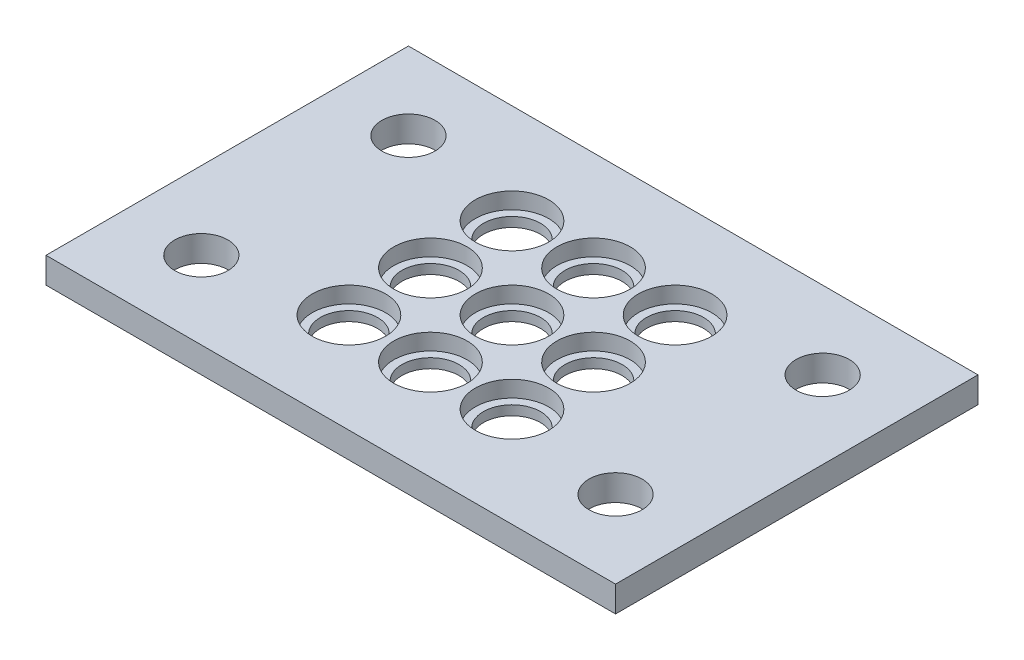
ISO-10303-21;
HEADER;
FILE_DESCRIPTION(('STEP AP214'),'2;1');
FILE_NAME('part.step','',(''),(''),'','','');
FILE_SCHEMA(('AUTOMOTIVE_DESIGN { 1 0 10303 214 1 1 1 1 }'));
ENDSEC;
DATA;
#1=APPLICATION_CONTEXT('core data for automotive mechanical design processes');
#2=APPLICATION_PROTOCOL_DEFINITION('international standard','automotive_design',2000,#1);
#3=PRODUCT_CONTEXT('',#1,'mechanical');
#4=PRODUCT('Part','Part','',(#3));
#5=PRODUCT_RELATED_PRODUCT_CATEGORY('part','',(#4));
#6=PRODUCT_DEFINITION_FORMATION('','',#4);
#7=PRODUCT_DEFINITION_CONTEXT('part definition',#1,'design');
#8=PRODUCT_DEFINITION('design','',#6,#7);
#9=PRODUCT_DEFINITION_SHAPE('','',#8);
#10=(LENGTH_UNIT() NAMED_UNIT(*) SI_UNIT(.MILLI.,.METRE.));
#11=(NAMED_UNIT(*) PLANE_ANGLE_UNIT() SI_UNIT($,.RADIAN.));
#12=(NAMED_UNIT(*) SI_UNIT($,.STERADIAN.) SOLID_ANGLE_UNIT());
#13=UNCERTAINTY_MEASURE_WITH_UNIT(LENGTH_MEASURE(1.E-05),#10,'distance_accuracy_value','');
#14=(GEOMETRIC_REPRESENTATION_CONTEXT(3) GLOBAL_UNCERTAINTY_ASSIGNED_CONTEXT((#13)) GLOBAL_UNIT_ASSIGNED_CONTEXT((#10,
#11,#12)) REPRESENTATION_CONTEXT('',''));
#15=CARTESIAN_POINT('',(0.,0.,0.));
#16=DIRECTION('',(0.,0.,1.));
#17=DIRECTION('',(1.,0.,0.));
#18=AXIS2_PLACEMENT_3D('',#15,#16,#17);
#19=CARTESIAN_POINT('',(44.9249999999999,3.175,-32.2250000000001));
#20=DIRECTION('',(0.,-1.,0.));
#21=DIRECTION('',(0.,0.,-1.));
#22=AXIS2_PLACEMENT_3D('',#19,#20,#21);
#23=CYLINDRICAL_SURFACE('',#22,3.5);
#24=CARTESIAN_POINT('',(44.9249999999999,0.,-32.2250000000001));
#25=DIRECTION('',(0.,1.,0.));
#26=DIRECTION('',(0.,0.,1.));
#27=AXIS2_PLACEMENT_3D('',#24,#25,#26);
#28=CIRCLE('',#27,3.5);
#29=CARTESIAN_POINT('',(44.9249999999999,0.,-28.7250000000001));
#30=VERTEX_POINT('',#29);
#31=EDGE_CURVE('E209',#30,#30,#28,.T.);
#32=ORIENTED_EDGE('',*,*,#31,.F.);
#33=EDGE_LOOP('',(#32));
#34=FACE_BOUND('',#33,.T.);
#35=CARTESIAN_POINT('',(44.9249999999999,1.175,-32.2250000000001));
#36=DIRECTION('',(0.,1.,0.));
#37=DIRECTION('',(0.,0.,1.));
#38=AXIS2_PLACEMENT_3D('',#35,#36,#37);
#39=CIRCLE('',#38,3.5);
#40=CARTESIAN_POINT('',(44.9249999999999,1.175,-28.7250000000001));
#41=VERTEX_POINT('',#40);
#42=EDGE_CURVE('E50',#41,#41,#39,.T.);
#43=ORIENTED_EDGE('',*,*,#42,.T.);
#44=EDGE_LOOP('',(#43));
#45=FACE_BOUND('',#44,.T.);
#46=ADVANCED_FACE('F46',(#34,#45),#23,.F.);
#47=CARTESIAN_POINT('',(34.9249999999999,3.175,-32.225));
#48=DIRECTION('',(0.,-1.,0.));
#49=DIRECTION('',(0.,0.,-1.));
#50=AXIS2_PLACEMENT_3D('',#47,#48,#49);
#51=CYLINDRICAL_SURFACE('',#50,3.5);
#52=CARTESIAN_POINT('',(34.9249999999999,0.,-32.225));
#53=DIRECTION('',(0.,1.,0.));
#54=DIRECTION('',(0.,0.,1.));
#55=AXIS2_PLACEMENT_3D('',#52,#53,#54);
#56=CIRCLE('',#55,3.5);
#57=CARTESIAN_POINT('',(34.9249999999999,0.,-28.725));
#58=VERTEX_POINT('',#57);
#59=EDGE_CURVE('E205',#58,#58,#56,.T.);
#60=ORIENTED_EDGE('',*,*,#59,.F.);
#61=EDGE_LOOP('',(#60));
#62=FACE_BOUND('',#61,.T.);
#63=CARTESIAN_POINT('',(34.9249999999999,1.175,-32.225));
#64=DIRECTION('',(0.,1.,0.));
#65=DIRECTION('',(0.,0.,1.));
#66=AXIS2_PLACEMENT_3D('',#63,#64,#65);
#67=CIRCLE('',#66,3.5);
#68=CARTESIAN_POINT('',(34.9249999999999,1.175,-28.725));
#69=VERTEX_POINT('',#68);
#70=EDGE_CURVE('E162',#69,#69,#67,.T.);
#71=ORIENTED_EDGE('',*,*,#70,.T.);
#72=EDGE_LOOP('',(#71));
#73=FACE_BOUND('',#72,.T.);
#74=ADVANCED_FACE('F265',(#62,#73),#51,.F.);
#75=CARTESIAN_POINT('',(24.9249999999999,3.175,-32.2249999999999));
#76=DIRECTION('',(0.,-1.,0.));
#77=DIRECTION('',(0.,0.,-1.));
#78=AXIS2_PLACEMENT_3D('',#75,#76,#77);
#79=CYLINDRICAL_SURFACE('',#78,3.5);
#80=CARTESIAN_POINT('',(24.9249999999999,0.,-32.2249999999999));
#81=DIRECTION('',(0.,1.,0.));
#82=DIRECTION('',(0.,0.,1.));
#83=AXIS2_PLACEMENT_3D('',#80,#81,#82);
#84=CIRCLE('',#83,3.5);
#85=CARTESIAN_POINT('',(24.9249999999999,0.,-28.7249999999999));
#86=VERTEX_POINT('',#85);
#87=EDGE_CURVE('E201',#86,#86,#84,.T.);
#88=ORIENTED_EDGE('',*,*,#87,.F.);
#89=EDGE_LOOP('',(#88));
#90=FACE_BOUND('',#89,.T.);
#91=CARTESIAN_POINT('',(24.9249999999999,1.175,-32.2249999999999));
#92=DIRECTION('',(0.,1.,0.));
#93=DIRECTION('',(0.,0.,1.));
#94=AXIS2_PLACEMENT_3D('',#91,#92,#93);
#95=CIRCLE('',#94,3.5);
#96=CARTESIAN_POINT('',(24.9249999999999,1.175,-28.7249999999999));
#97=VERTEX_POINT('',#96);
#98=EDGE_CURVE('E159',#97,#97,#95,.T.);
#99=ORIENTED_EDGE('',*,*,#98,.T.);
#100=EDGE_LOOP('',(#99));
#101=FACE_BOUND('',#100,.T.);
#102=ADVANCED_FACE('F272',(#90,#101),#79,.F.);
#103=CARTESIAN_POINT('',(34.925,3.175,-22.225));
#104=DIRECTION('',(0.,-1.,0.));
#105=DIRECTION('',(0.,0.,-1.));
#106=AXIS2_PLACEMENT_3D('',#103,#104,#105);
#107=CYLINDRICAL_SURFACE('',#106,3.5);
#108=CARTESIAN_POINT('',(34.925,0.,-22.225));
#109=DIRECTION('',(0.,1.,0.));
#110=DIRECTION('',(0.,0.,1.));
#111=AXIS2_PLACEMENT_3D('',#108,#109,#110);
#112=CIRCLE('',#111,3.5);
#113=CARTESIAN_POINT('',(34.925,0.,-18.725));
#114=VERTEX_POINT('',#113);
#115=EDGE_CURVE('E197',#114,#114,#112,.T.);
#116=ORIENTED_EDGE('',*,*,#115,.F.);
#117=EDGE_LOOP('',(#116));
#118=FACE_BOUND('',#117,.T.);
#119=CARTESIAN_POINT('',(34.925,1.175,-22.225));
#120=DIRECTION('',(0.,1.,0.));
#121=DIRECTION('',(0.,0.,1.));
#122=AXIS2_PLACEMENT_3D('',#119,#120,#121);
#123=CIRCLE('',#122,3.5);
#124=CARTESIAN_POINT('',(34.925,1.175,-18.725));
#125=VERTEX_POINT('',#124);
#126=EDGE_CURVE('E155',#125,#125,#123,.T.);
#127=ORIENTED_EDGE('',*,*,#126,.T.);
#128=EDGE_LOOP('',(#127));
#129=FACE_BOUND('',#128,.T.);
#130=ADVANCED_FACE('F470',(#118,#129),#107,.F.);
#131=CARTESIAN_POINT('',(24.925,3.175,-22.2249999999999));
#132=DIRECTION('',(0.,-1.,0.));
#133=DIRECTION('',(0.,0.,-1.));
#134=AXIS2_PLACEMENT_3D('',#131,#132,#133);
#135=CYLINDRICAL_SURFACE('',#134,3.5);
#136=CARTESIAN_POINT('',(24.925,0.,-22.2249999999999));
#137=DIRECTION('',(0.,1.,0.));
#138=DIRECTION('',(0.,0.,1.));
#139=AXIS2_PLACEMENT_3D('',#136,#137,#138);
#140=CIRCLE('',#139,3.5);
#141=CARTESIAN_POINT('',(24.925,0.,-18.7249999999999));
#142=VERTEX_POINT('',#141);
#143=EDGE_CURVE('E193',#142,#142,#140,.T.);
#144=ORIENTED_EDGE('',*,*,#143,.F.);
#145=EDGE_LOOP('',(#144));
#146=FACE_BOUND('',#145,.T.);
#147=CARTESIAN_POINT('',(24.925,1.175,-22.2249999999999));
#148=DIRECTION('',(0.,1.,0.));
#149=DIRECTION('',(0.,0.,1.));
#150=AXIS2_PLACEMENT_3D('',#147,#148,#149);
#151=CIRCLE('',#150,3.5);
#152=CARTESIAN_POINT('',(24.925,1.175,-18.7249999999999));
#153=VERTEX_POINT('',#152);
#154=EDGE_CURVE('E151',#153,#153,#151,.T.);
#155=ORIENTED_EDGE('',*,*,#154,.T.);
#156=EDGE_LOOP('',(#155));
#157=FACE_BOUND('',#156,.T.);
#158=ADVANCED_FACE('F466',(#146,#157),#135,.F.);
#159=CARTESIAN_POINT('',(34.9250000000001,3.175,-12.225));
#160=DIRECTION('',(0.,-1.,0.));
#161=DIRECTION('',(0.,0.,-1.));
#162=AXIS2_PLACEMENT_3D('',#159,#160,#161);
#163=CYLINDRICAL_SURFACE('',#162,3.5);
#164=CARTESIAN_POINT('',(34.9250000000001,0.,-12.225));
#165=DIRECTION('',(0.,1.,0.));
#166=DIRECTION('',(0.,0.,1.));
#167=AXIS2_PLACEMENT_3D('',#164,#165,#166);
#168=CIRCLE('',#167,3.5);
#169=CARTESIAN_POINT('',(34.9250000000001,0.,-8.725));
#170=VERTEX_POINT('',#169);
#171=EDGE_CURVE('E189',#170,#170,#168,.T.);
#172=ORIENTED_EDGE('',*,*,#171,.F.);
#173=EDGE_LOOP('',(#172));
#174=FACE_BOUND('',#173,.T.);
#175=CARTESIAN_POINT('',(34.9250000000001,1.175,-12.225));
#176=DIRECTION('',(0.,1.,0.));
#177=DIRECTION('',(0.,0.,1.));
#178=AXIS2_PLACEMENT_3D('',#175,#176,#177);
#179=CIRCLE('',#178,3.5);
#180=CARTESIAN_POINT('',(34.9250000000001,1.175,-8.725));
#181=VERTEX_POINT('',#180);
#182=EDGE_CURVE('E147',#181,#181,#179,.T.);
#183=ORIENTED_EDGE('',*,*,#182,.T.);
#184=EDGE_LOOP('',(#183));
#185=FACE_BOUND('',#184,.T.);
#186=ADVANCED_FACE('F304',(#174,#185),#163,.F.);
#187=CARTESIAN_POINT('',(24.9250000000001,3.175,-12.2249999999999));
#188=DIRECTION('',(0.,-1.,0.));
#189=DIRECTION('',(0.,0.,-1.));
#190=AXIS2_PLACEMENT_3D('',#187,#188,#189);
#191=CYLINDRICAL_SURFACE('',#190,3.5);
#192=CARTESIAN_POINT('',(24.9250000000001,0.,-12.2249999999999));
#193=DIRECTION('',(0.,1.,0.));
#194=DIRECTION('',(0.,0.,1.));
#195=AXIS2_PLACEMENT_3D('',#192,#193,#194);
#196=CIRCLE('',#195,3.5);
#197=CARTESIAN_POINT('',(24.9250000000001,0.,-8.72499999999992));
#198=VERTEX_POINT('',#197);
#199=EDGE_CURVE('E180',#198,#198,#196,.T.);
#200=ORIENTED_EDGE('',*,*,#199,.F.);
#201=EDGE_LOOP('',(#200));
#202=FACE_BOUND('',#201,.T.);
#203=CARTESIAN_POINT('',(24.9250000000001,1.175,-12.2249999999999));
#204=DIRECTION('',(0.,1.,0.));
#205=DIRECTION('',(0.,0.,1.));
#206=AXIS2_PLACEMENT_3D('',#203,#204,#205);
#207=CIRCLE('',#206,3.5);
#208=CARTESIAN_POINT('',(24.9250000000001,1.175,-8.72499999999992));
#209=VERTEX_POINT('',#208);
#210=EDGE_CURVE('E143',#209,#209,#207,.T.);
#211=ORIENTED_EDGE('',*,*,#210,.T.);
#212=EDGE_LOOP('',(#211));
#213=FACE_BOUND('',#212,.T.);
#214=ADVANCED_FACE('F300',(#202,#213),#191,.F.);
#215=CARTESIAN_POINT('',(44.925,3.175,-22.2250000000001));
#216=DIRECTION('',(0.,-1.,0.));
#217=DIRECTION('',(0.,0.,-1.));
#218=AXIS2_PLACEMENT_3D('',#215,#216,#217);
#219=CYLINDRICAL_SURFACE('',#218,3.5);
#220=CARTESIAN_POINT('',(44.925,0.,-22.2250000000001));
#221=DIRECTION('',(0.,1.,0.));
#222=DIRECTION('',(0.,0.,1.));
#223=AXIS2_PLACEMENT_3D('',#220,#221,#222);
#224=CIRCLE('',#223,3.5);
#225=CARTESIAN_POINT('',(44.925,0.,-18.7250000000001));
#226=VERTEX_POINT('',#225);
#227=EDGE_CURVE('E174',#226,#226,#224,.T.);
#228=ORIENTED_EDGE('',*,*,#227,.F.);
#229=EDGE_LOOP('',(#228));
#230=FACE_BOUND('',#229,.T.);
#231=CARTESIAN_POINT('',(44.925,1.175,-22.2250000000001));
#232=DIRECTION('',(0.,1.,0.));
#233=DIRECTION('',(0.,0.,1.));
#234=AXIS2_PLACEMENT_3D('',#231,#232,#233);
#235=CIRCLE('',#234,3.5);
#236=CARTESIAN_POINT('',(44.925,1.175,-18.7250000000001));
#237=VERTEX_POINT('',#236);
#238=EDGE_CURVE('E138',#237,#237,#235,.T.);
#239=ORIENTED_EDGE('',*,*,#238,.T.);
#240=EDGE_LOOP('',(#239));
#241=FACE_BOUND('',#240,.T.);
#242=ADVANCED_FACE('F303',(#230,#241),#219,.F.);
#243=CARTESIAN_POINT('',(44.9250000000001,3.175,-12.2250000000001));
#244=DIRECTION('',(0.,-1.,0.));
#245=DIRECTION('',(0.,0.,-1.));
#246=AXIS2_PLACEMENT_3D('',#243,#244,#245);
#247=CYLINDRICAL_SURFACE('',#246,3.5);
#248=CARTESIAN_POINT('',(44.9250000000001,0.,-12.2250000000001));
#249=DIRECTION('',(0.,1.,0.));
#250=DIRECTION('',(0.,0.,1.));
#251=AXIS2_PLACEMENT_3D('',#248,#249,#250);
#252=CIRCLE('',#251,3.5);
#253=CARTESIAN_POINT('',(44.9250000000001,0.,-8.72500000000007));
#254=VERTEX_POINT('',#253);
#255=EDGE_CURVE('E169',#254,#254,#252,.T.);
#256=ORIENTED_EDGE('',*,*,#255,.F.);
#257=EDGE_LOOP('',(#256));
#258=FACE_BOUND('',#257,.T.);
#259=CARTESIAN_POINT('',(44.9250000000001,1.175,-12.2250000000001));
#260=DIRECTION('',(0.,1.,0.));
#261=DIRECTION('',(0.,0.,1.));
#262=AXIS2_PLACEMENT_3D('',#259,#260,#261);
#263=CIRCLE('',#262,3.5);
#264=CARTESIAN_POINT('',(44.9250000000001,1.175,-8.72500000000007));
#265=VERTEX_POINT('',#264);
#266=EDGE_CURVE('E134',#265,#265,#263,.T.);
#267=ORIENTED_EDGE('',*,*,#266,.T.);
#268=EDGE_LOOP('',(#267));
#269=FACE_BOUND('',#268,.T.);
#270=ADVANCED_FACE('F396',(#258,#269),#247,.F.);
#271=CARTESIAN_POINT('',(0.,3.175,0.));
#272=DIRECTION('',(0.,-1.,0.));
#273=DIRECTION('',(0.,0.,-1.));
#274=AXIS2_PLACEMENT_3D('',#271,#272,#273);
#275=PLANE('',#274);
#276=CARTESIAN_POINT('',(34.9250000000001,3.175,-12.225));
#277=DIRECTION('',(0.,1.,0.));
#278=DIRECTION('',(0.,0.,1.));
#279=AXIS2_PLACEMENT_3D('',#276,#277,#278);
#280=CIRCLE('',#279,4.5);
#281=CARTESIAN_POINT('',(34.9250000000001,3.175,-7.725));
#282=VERTEX_POINT('',#281);
#283=EDGE_CURVE('E349',#282,#282,#280,.T.);
#284=ORIENTED_EDGE('',*,*,#283,.F.);
#285=EDGE_LOOP('',(#284));
#286=FACE_BOUND('',#285,.T.);
#287=CARTESIAN_POINT('',(24.9250000000001,3.175,-12.2249999999999));
#288=DIRECTION('',(0.,1.,0.));
#289=DIRECTION('',(0.,0.,1.));
#290=AXIS2_PLACEMENT_3D('',#287,#288,#289);
#291=CIRCLE('',#290,4.5);
#292=CARTESIAN_POINT('',(24.9250000000001,3.175,-7.72499999999993));
#293=VERTEX_POINT('',#292);
#294=EDGE_CURVE('E319',#293,#293,#291,.T.);
#295=ORIENTED_EDGE('',*,*,#294,.F.);
#296=EDGE_LOOP('',(#295));
#297=FACE_BOUND('',#296,.T.);
#298=CARTESIAN_POINT('',(34.9250000000001,3.175,-22.225));
#299=DIRECTION('',(0.,1.,0.));
#300=DIRECTION('',(0.,0.,1.));
#301=AXIS2_PLACEMENT_3D('',#298,#299,#300);
#302=CIRCLE('',#301,4.5);
#303=CARTESIAN_POINT('',(34.9250000000001,3.175,-17.725));
#304=VERTEX_POINT('',#303);
#305=EDGE_CURVE('E320',#304,#304,#302,.T.);
#306=ORIENTED_EDGE('',*,*,#305,.F.);
#307=EDGE_LOOP('',(#306));
#308=FACE_BOUND('',#307,.T.);
#309=CARTESIAN_POINT('',(24.9250000000001,3.175,-22.2249999999999));
#310=DIRECTION('',(0.,1.,0.));
#311=DIRECTION('',(0.,0.,1.));
#312=AXIS2_PLACEMENT_3D('',#309,#310,#311);
#313=CIRCLE('',#312,4.5);
#314=CARTESIAN_POINT('',(24.9250000000001,3.175,-17.7249999999999));
#315=VERTEX_POINT('',#314);
#316=EDGE_CURVE('E335',#315,#315,#313,.T.);
#317=ORIENTED_EDGE('',*,*,#316,.F.);
#318=EDGE_LOOP('',(#317));
#319=FACE_BOUND('',#318,.T.);
#320=CARTESIAN_POINT('',(34.925,3.175,-32.225));
#321=DIRECTION('',(0.,1.,0.));
#322=DIRECTION('',(0.,0.,1.));
#323=AXIS2_PLACEMENT_3D('',#320,#321,#322);
#324=CIRCLE('',#323,4.5);
#325=CARTESIAN_POINT('',(34.925,3.175,-27.725));
#326=VERTEX_POINT('',#325);
#327=EDGE_CURVE('E342',#326,#326,#324,.T.);
#328=ORIENTED_EDGE('',*,*,#327,.F.);
#329=EDGE_LOOP('',(#328));
#330=FACE_BOUND('',#329,.T.);
#331=CARTESIAN_POINT('',(24.925,3.175,-32.2249999999999));
#332=DIRECTION('',(0.,1.,0.));
#333=DIRECTION('',(0.,0.,1.));
#334=AXIS2_PLACEMENT_3D('',#331,#332,#333);
#335=CIRCLE('',#334,4.5);
#336=CARTESIAN_POINT('',(24.925,3.175,-27.7249999999999));
#337=VERTEX_POINT('',#336);
#338=EDGE_CURVE('E380',#337,#337,#335,.T.);
#339=ORIENTED_EDGE('',*,*,#338,.F.);
#340=EDGE_LOOP('',(#339));
#341=FACE_BOUND('',#340,.T.);
#342=CARTESIAN_POINT('',(44.9250000000001,3.175,-22.2250000000001));
#343=DIRECTION('',(0.,1.,0.));
#344=DIRECTION('',(0.,0.,1.));
#345=AXIS2_PLACEMENT_3D('',#342,#343,#344);
#346=CIRCLE('',#345,4.5);
#347=CARTESIAN_POINT('',(44.9250000000001,3.175,-17.7250000000001));
#348=VERTEX_POINT('',#347);
#349=EDGE_CURVE('E372',#348,#348,#346,.T.);
#350=ORIENTED_EDGE('',*,*,#349,.F.);
#351=EDGE_LOOP('',(#350));
#352=FACE_BOUND('',#351,.T.);
#353=CARTESIAN_POINT('',(44.925,3.175,-32.2250000000001));
#354=DIRECTION('',(0.,1.,0.));
#355=DIRECTION('',(0.,0.,1.));
#356=AXIS2_PLACEMENT_3D('',#353,#354,#355);
#357=CIRCLE('',#356,4.5);
#358=CARTESIAN_POINT('',(44.925,3.175,-27.7250000000001));
#359=VERTEX_POINT('',#358);
#360=EDGE_CURVE('E364',#359,#359,#357,.T.);
#361=ORIENTED_EDGE('',*,*,#360,.F.);
#362=EDGE_LOOP('',(#361));
#363=FACE_BOUND('',#362,.T.);
#364=CARTESIAN_POINT('',(44.9250000000001,3.175,-12.2250000000001));
#365=DIRECTION('',(0.,1.,0.));
#366=DIRECTION('',(0.,0.,1.));
#367=AXIS2_PLACEMENT_3D('',#364,#365,#366);
#368=CIRCLE('',#367,4.5);
#369=CARTESIAN_POINT('',(44.9250000000001,3.175,-7.72500000000007));
#370=VERTEX_POINT('',#369);
#371=EDGE_CURVE('E183',#370,#370,#368,.T.);
#372=ORIENTED_EDGE('',*,*,#371,.F.);
#373=EDGE_LOOP('',(#372));
#374=FACE_BOUND('',#373,.T.);
#375=DIRECTION('',(0.,0.,1.));
#376=VECTOR('',#375,1.);
#377=CARTESIAN_POINT('',(0.,3.175,0.));
#378=LINE('',#377,#376);
#379=CARTESIAN_POINT('',(0.,3.175,-44.45));
#380=VERTEX_POINT('',#379);
#381=CARTESIAN_POINT('',(0.,3.175,0.));
#382=VERTEX_POINT('',#381);
#383=EDGE_CURVE('E102',#380,#382,#378,.T.);
#384=ORIENTED_EDGE('',*,*,#383,.T.);
#385=DIRECTION('',(1.,0.,0.));
#386=VECTOR('',#385,1.);
#387=CARTESIAN_POINT('',(0.,3.175,0.));
#388=LINE('',#387,#386);
#389=CARTESIAN_POINT('',(69.85,3.175,0.));
#390=VERTEX_POINT('',#389);
#391=EDGE_CURVE('E96',#382,#390,#388,.T.);
#392=ORIENTED_EDGE('',*,*,#391,.T.);
#393=DIRECTION('',(0.,0.,-1.));
#394=VECTOR('',#393,1.);
#395=CARTESIAN_POINT('',(69.85,3.175,0.));
#396=LINE('',#395,#394);
#397=CARTESIAN_POINT('',(69.85,3.175,-44.45));
#398=VERTEX_POINT('',#397);
#399=EDGE_CURVE('E100',#390,#398,#396,.T.);
#400=ORIENTED_EDGE('',*,*,#399,.T.);
#401=DIRECTION('',(-1.,0.,0.));
#402=VECTOR('',#401,1.);
#403=CARTESIAN_POINT('',(0.,3.175,-44.45));
#404=LINE('',#403,#402);
#405=EDGE_CURVE('E66',#398,#380,#404,.T.);
#406=ORIENTED_EDGE('',*,*,#405,.T.);
#407=EDGE_LOOP('',(#384,#392,#400,#406));
#408=FACE_BOUND('',#407,.T.);
#409=CARTESIAN_POINT('',(9.525,3.175,-34.925));
#410=DIRECTION('',(0.,1.,0.));
#411=DIRECTION('',(0.,0.,1.));
#412=AXIS2_PLACEMENT_3D('',#409,#410,#411);
#413=CIRCLE('',#412,3.2639);
#414=CARTESIAN_POINT('',(9.525,3.175,-31.6611));
#415=VERTEX_POINT('',#414);
#416=EDGE_CURVE('E123',#415,#415,#413,.T.);
#417=ORIENTED_EDGE('',*,*,#416,.F.);
#418=EDGE_LOOP('',(#417));
#419=FACE_BOUND('',#418,.T.);
#420=CARTESIAN_POINT('',(60.325,3.175,-34.925));
#421=DIRECTION('',(0.,1.,0.));
#422=DIRECTION('',(0.,0.,1.));
#423=AXIS2_PLACEMENT_3D('',#420,#421,#422);
#424=CIRCLE('',#423,3.2639);
#425=CARTESIAN_POINT('',(60.325,3.175,-31.6611));
#426=VERTEX_POINT('',#425);
#427=EDGE_CURVE('E230',#426,#426,#424,.T.);
#428=ORIENTED_EDGE('',*,*,#427,.F.);
#429=EDGE_LOOP('',(#428));
#430=FACE_BOUND('',#429,.T.);
#431=CARTESIAN_POINT('',(9.525,3.175,-9.525));
#432=DIRECTION('',(0.,1.,0.));
#433=DIRECTION('',(0.,0.,1.));
#434=AXIS2_PLACEMENT_3D('',#431,#432,#433);
#435=CIRCLE('',#434,3.2639);
#436=CARTESIAN_POINT('',(9.525,3.175,-6.2611));
#437=VERTEX_POINT('',#436);
#438=EDGE_CURVE('E222',#437,#437,#435,.T.);
#439=ORIENTED_EDGE('',*,*,#438,.F.);
#440=EDGE_LOOP('',(#439));
#441=FACE_BOUND('',#440,.T.);
#442=CARTESIAN_POINT('',(60.325,3.175,-9.525));
#443=DIRECTION('',(0.,1.,0.));
#444=DIRECTION('',(0.,0.,1.));
#445=AXIS2_PLACEMENT_3D('',#442,#443,#444);
#446=CIRCLE('',#445,3.2639);
#447=CARTESIAN_POINT('',(60.325,3.175,-6.2611));
#448=VERTEX_POINT('',#447);
#449=EDGE_CURVE('E214',#448,#448,#446,.T.);
#450=ORIENTED_EDGE('',*,*,#449,.F.);
#451=EDGE_LOOP('',(#450));
#452=FACE_BOUND('',#451,.T.);
#453=ADVANCED_FACE('F97',(#286,#297,#308,#319,#330,#341,#352,#363,#374,#408,#419,#430,#441,
#452),#275,.F.);
#454=CARTESIAN_POINT('',(0.,0.,0.));
#455=DIRECTION('',(0.,-1.,0.));
#456=DIRECTION('',(0.,0.,-1.));
#457=AXIS2_PLACEMENT_3D('',#454,#455,#456);
#458=PLANE('',#457);
#459=ORIENTED_EDGE('',*,*,#227,.T.);
#460=EDGE_LOOP('',(#459));
#461=FACE_BOUND('',#460,.T.);
#462=ORIENTED_EDGE('',*,*,#171,.T.);
#463=EDGE_LOOP('',(#462));
#464=FACE_BOUND('',#463,.T.);
#465=ORIENTED_EDGE('',*,*,#115,.T.);
#466=EDGE_LOOP('',(#465));
#467=FACE_BOUND('',#466,.T.);
#468=ORIENTED_EDGE('',*,*,#59,.T.);
#469=EDGE_LOOP('',(#468));
#470=FACE_BOUND('',#469,.T.);
#471=CARTESIAN_POINT('',(60.325,0.,-9.525));
#472=DIRECTION('',(0.,1.,0.));
#473=DIRECTION('',(0.,0.,1.));
#474=AXIS2_PLACEMENT_3D('',#471,#472,#473);
#475=CIRCLE('',#474,3.2639);
#476=CARTESIAN_POINT('',(60.325,0.,-6.2611));
#477=VERTEX_POINT('',#476);
#478=EDGE_CURVE('E213',#477,#477,#475,.T.);
#479=ORIENTED_EDGE('',*,*,#478,.T.);
#480=EDGE_LOOP('',(#479));
#481=FACE_BOUND('',#480,.T.);
#482=CARTESIAN_POINT('',(60.325,0.,-34.925));
#483=DIRECTION('',(0.,1.,0.));
#484=DIRECTION('',(0.,0.,1.));
#485=AXIS2_PLACEMENT_3D('',#482,#483,#484);
#486=CIRCLE('',#485,3.2639);
#487=CARTESIAN_POINT('',(60.325,0.,-31.6611));
#488=VERTEX_POINT('',#487);
#489=EDGE_CURVE('E226',#488,#488,#486,.T.);
#490=ORIENTED_EDGE('',*,*,#489,.T.);
#491=EDGE_LOOP('',(#490));
#492=FACE_BOUND('',#491,.T.);
#493=DIRECTION('',(0.,0.,1.));
#494=VECTOR('',#493,1.);
#495=CARTESIAN_POINT('',(0.,0.,0.));
#496=LINE('',#495,#494);
#497=CARTESIAN_POINT('',(0.,0.,-44.45));
#498=VERTEX_POINT('',#497);
#499=CARTESIAN_POINT('',(0.,0.,0.));
#500=VERTEX_POINT('',#499);
#501=EDGE_CURVE('E119',#498,#500,#496,.T.);
#502=ORIENTED_EDGE('',*,*,#501,.F.);
#503=DIRECTION('',(-1.,0.,0.));
#504=VECTOR('',#503,1.);
#505=CARTESIAN_POINT('',(0.,0.,-44.45));
#506=LINE('',#505,#504);
#507=CARTESIAN_POINT('',(69.85,0.,-44.45));
#508=VERTEX_POINT('',#507);
#509=EDGE_CURVE('E89',#508,#498,#506,.T.);
#510=ORIENTED_EDGE('',*,*,#509,.F.);
#511=DIRECTION('',(0.,0.,-1.));
#512=VECTOR('',#511,1.);
#513=CARTESIAN_POINT('',(69.85,0.,0.));
#514=LINE('',#513,#512);
#515=CARTESIAN_POINT('',(69.85,0.,0.));
#516=VERTEX_POINT('',#515);
#517=EDGE_CURVE('E83',#516,#508,#514,.T.);
#518=ORIENTED_EDGE('',*,*,#517,.F.);
#519=DIRECTION('',(1.,0.,0.));
#520=VECTOR('',#519,1.);
#521=CARTESIAN_POINT('',(0.,0.,0.));
#522=LINE('',#521,#520);
#523=EDGE_CURVE('E107',#500,#516,#522,.T.);
#524=ORIENTED_EDGE('',*,*,#523,.F.);
#525=EDGE_LOOP('',(#502,#510,#518,#524));
#526=FACE_BOUND('',#525,.T.);
#527=CARTESIAN_POINT('',(9.525,0.,-34.925));
#528=DIRECTION('',(0.,1.,0.));
#529=DIRECTION('',(0.,0.,1.));
#530=AXIS2_PLACEMENT_3D('',#527,#528,#529);
#531=CIRCLE('',#530,3.2639);
#532=CARTESIAN_POINT('',(9.525,0.,-31.6611));
#533=VERTEX_POINT('',#532);
#534=EDGE_CURVE('E234',#533,#533,#531,.T.);
#535=ORIENTED_EDGE('',*,*,#534,.T.);
#536=EDGE_LOOP('',(#535));
#537=FACE_BOUND('',#536,.T.);
#538=CARTESIAN_POINT('',(9.525,0.,-9.525));
#539=DIRECTION('',(0.,1.,0.));
#540=DIRECTION('',(0.,0.,1.));
#541=AXIS2_PLACEMENT_3D('',#538,#539,#540);
#542=CIRCLE('',#541,3.2639);
#543=CARTESIAN_POINT('',(9.525,0.,-6.2611));
#544=VERTEX_POINT('',#543);
#545=EDGE_CURVE('E218',#544,#544,#542,.T.);
#546=ORIENTED_EDGE('',*,*,#545,.T.);
#547=EDGE_LOOP('',(#546));
#548=FACE_BOUND('',#547,.T.);
#549=ORIENTED_EDGE('',*,*,#31,.T.);
#550=EDGE_LOOP('',(#549));
#551=FACE_BOUND('',#550,.T.);
#552=ORIENTED_EDGE('',*,*,#87,.T.);
#553=EDGE_LOOP('',(#552));
#554=FACE_BOUND('',#553,.T.);
#555=ORIENTED_EDGE('',*,*,#143,.T.);
#556=EDGE_LOOP('',(#555));
#557=FACE_BOUND('',#556,.T.);
#558=ORIENTED_EDGE('',*,*,#199,.T.);
#559=EDGE_LOOP('',(#558));
#560=FACE_BOUND('',#559,.T.);
#561=ORIENTED_EDGE('',*,*,#255,.T.);
#562=EDGE_LOOP('',(#561));
#563=FACE_BOUND('',#562,.T.);
#564=ADVANCED_FACE('F246',(#461,#464,#467,#470,#481,#492,#526,#537,#548,#551,#554,#557,#560,
#563),#458,.T.);
#565=CARTESIAN_POINT('',(0.,3.175,0.));
#566=DIRECTION('',(1.,0.,0.));
#567=DIRECTION('',(0.,0.,-1.));
#568=AXIS2_PLACEMENT_3D('',#565,#566,#567);
#569=PLANE('',#568);
#570=ORIENTED_EDGE('',*,*,#501,.T.);
#571=DIRECTION('',(0.,-1.,0.));
#572=VECTOR('',#571,1.);
#573=CARTESIAN_POINT('',(0.,3.175,0.));
#574=LINE('',#573,#572);
#575=EDGE_CURVE('E12',#382,#500,#574,.T.);
#576=ORIENTED_EDGE('',*,*,#575,.F.);
#577=ORIENTED_EDGE('',*,*,#383,.F.);
#578=DIRECTION('',(0.,-1.,0.));
#579=VECTOR('',#578,1.);
#580=CARTESIAN_POINT('',(0.,3.175,-44.45));
#581=LINE('',#580,#579);
#582=EDGE_CURVE('E115',#380,#498,#581,.T.);
#583=ORIENTED_EDGE('',*,*,#582,.T.);
#584=EDGE_LOOP('',(#570,#576,#577,#583));
#585=FACE_BOUND('',#584,.T.);
#586=ADVANCED_FACE('F48',(#585),#569,.F.);
#587=CARTESIAN_POINT('',(0.,3.175,0.));
#588=DIRECTION('',(0.,0.,-1.));
#589=DIRECTION('',(-1.,0.,0.));
#590=AXIS2_PLACEMENT_3D('',#587,#588,#589);
#591=PLANE('',#590);
#592=ORIENTED_EDGE('',*,*,#523,.T.);
#593=DIRECTION('',(0.,-1.,0.));
#594=VECTOR('',#593,1.);
#595=CARTESIAN_POINT('',(69.85,3.175,0.));
#596=LINE('',#595,#594);
#597=EDGE_CURVE('E57',#390,#516,#596,.T.);
#598=ORIENTED_EDGE('',*,*,#597,.F.);
#599=ORIENTED_EDGE('',*,*,#391,.F.);
#600=ORIENTED_EDGE('',*,*,#575,.T.);
#601=EDGE_LOOP('',(#592,#598,#599,#600));
#602=FACE_BOUND('',#601,.T.);
#603=ADVANCED_FACE('F106',(#602),#591,.F.);
#604=CARTESIAN_POINT('',(69.85,3.175,0.));
#605=DIRECTION('',(-1.,0.,0.));
#606=DIRECTION('',(0.,0.,1.));
#607=AXIS2_PLACEMENT_3D('',#604,#605,#606);
#608=PLANE('',#607);
#609=ORIENTED_EDGE('',*,*,#517,.T.);
#610=DIRECTION('',(0.,-1.,0.));
#611=VECTOR('',#610,1.);
#612=CARTESIAN_POINT('',(69.85,3.175,-44.45));
#613=LINE('',#612,#611);
#614=EDGE_CURVE('E109',#398,#508,#613,.T.);
#615=ORIENTED_EDGE('',*,*,#614,.F.);
#616=ORIENTED_EDGE('',*,*,#399,.F.);
#617=ORIENTED_EDGE('',*,*,#597,.T.);
#618=EDGE_LOOP('',(#609,#615,#616,#617));
#619=FACE_BOUND('',#618,.T.);
#620=ADVANCED_FACE('F111',(#619),#608,.F.);
#621=CARTESIAN_POINT('',(0.,3.175,-44.45));
#622=DIRECTION('',(0.,0.,1.));
#623=DIRECTION('',(1.,0.,0.));
#624=AXIS2_PLACEMENT_3D('',#621,#622,#623);
#625=PLANE('',#624);
#626=ORIENTED_EDGE('',*,*,#509,.T.);
#627=ORIENTED_EDGE('',*,*,#582,.F.);
#628=ORIENTED_EDGE('',*,*,#405,.F.);
#629=ORIENTED_EDGE('',*,*,#614,.T.);
#630=EDGE_LOOP('',(#626,#627,#628,#629));
#631=FACE_BOUND('',#630,.T.);
#632=ADVANCED_FACE('F252',(#631),#625,.F.);
#633=CARTESIAN_POINT('',(9.525,3.175,-34.925));
#634=DIRECTION('',(0.,-1.,0.));
#635=DIRECTION('',(0.,0.,-1.));
#636=AXIS2_PLACEMENT_3D('',#633,#634,#635);
#637=CYLINDRICAL_SURFACE('',#636,3.2639);
#638=ORIENTED_EDGE('',*,*,#416,.T.);
#639=EDGE_LOOP('',(#638));
#640=FACE_BOUND('',#639,.T.);
#641=ORIENTED_EDGE('',*,*,#534,.F.);
#642=EDGE_LOOP('',(#641));
#643=FACE_BOUND('',#642,.T.);
#644=ADVANCED_FACE('F249',(#640,#643),#637,.F.);
#645=CARTESIAN_POINT('',(60.325,3.175,-34.925));
#646=DIRECTION('',(0.,-1.,0.));
#647=DIRECTION('',(0.,0.,-1.));
#648=AXIS2_PLACEMENT_3D('',#645,#646,#647);
#649=CYLINDRICAL_SURFACE('',#648,3.2639);
#650=ORIENTED_EDGE('',*,*,#427,.T.);
#651=EDGE_LOOP('',(#650));
#652=FACE_BOUND('',#651,.T.);
#653=ORIENTED_EDGE('',*,*,#489,.F.);
#654=EDGE_LOOP('',(#653));
#655=FACE_BOUND('',#654,.T.);
#656=ADVANCED_FACE('F251',(#652,#655),#649,.F.);
#657=CARTESIAN_POINT('',(9.525,3.175,-9.525));
#658=DIRECTION('',(0.,-1.,0.));
#659=DIRECTION('',(0.,0.,-1.));
#660=AXIS2_PLACEMENT_3D('',#657,#658,#659);
#661=CYLINDRICAL_SURFACE('',#660,3.2639);
#662=ORIENTED_EDGE('',*,*,#438,.T.);
#663=EDGE_LOOP('',(#662));
#664=FACE_BOUND('',#663,.T.);
#665=ORIENTED_EDGE('',*,*,#545,.F.);
#666=EDGE_LOOP('',(#665));
#667=FACE_BOUND('',#666,.T.);
#668=ADVANCED_FACE('F259',(#664,#667),#661,.F.);
#669=CARTESIAN_POINT('',(60.325,3.175,-9.525));
#670=DIRECTION('',(0.,-1.,0.));
#671=DIRECTION('',(0.,0.,-1.));
#672=AXIS2_PLACEMENT_3D('',#669,#670,#671);
#673=CYLINDRICAL_SURFACE('',#672,3.2639);
#674=ORIENTED_EDGE('',*,*,#449,.T.);
#675=EDGE_LOOP('',(#674));
#676=FACE_BOUND('',#675,.T.);
#677=ORIENTED_EDGE('',*,*,#478,.F.);
#678=EDGE_LOOP('',(#677));
#679=FACE_BOUND('',#678,.T.);
#680=ADVANCED_FACE('F278',(#676,#679),#673,.F.);
#681=CARTESIAN_POINT('',(44.9250000000001,1.175,-12.2250000000001));
#682=DIRECTION('',(0.,1.,0.));
#683=DIRECTION('',(0.,0.,1.));
#684=AXIS2_PLACEMENT_3D('',#681,#682,#683);
#685=CYLINDRICAL_SURFACE('',#684,4.5);
#686=CARTESIAN_POINT('',(44.9250000000001,1.175,-12.2250000000001));
#687=DIRECTION('',(0.,1.,0.));
#688=DIRECTION('',(0.,0.,1.));
#689=AXIS2_PLACEMENT_3D('',#686,#687,#688);
#690=CIRCLE('',#689,4.5);
#691=CARTESIAN_POINT('',(44.9250000000001,1.175,-7.72500000000007));
#692=VERTEX_POINT('',#691);
#693=EDGE_CURVE('E139',#692,#692,#690,.T.);
#694=ORIENTED_EDGE('',*,*,#693,.F.);
#695=EDGE_LOOP('',(#694));
#696=FACE_BOUND('',#695,.T.);
#697=ORIENTED_EDGE('',*,*,#371,.T.);
#698=EDGE_LOOP('',(#697));
#699=FACE_BOUND('',#698,.T.);
#700=ADVANCED_FACE('F280',(#696,#699),#685,.F.);
#701=CARTESIAN_POINT('',(44.9250000000001,1.175,-12.2250000000001));
#702=DIRECTION('',(0.,1.,0.));
#703=DIRECTION('',(0.,0.,1.));
#704=AXIS2_PLACEMENT_3D('',#701,#702,#703);
#705=PLANE('',#704);
#706=ORIENTED_EDGE('',*,*,#266,.F.);
#707=EDGE_LOOP('',(#706));
#708=FACE_BOUND('',#707,.T.);
#709=ORIENTED_EDGE('',*,*,#693,.T.);
#710=EDGE_LOOP('',(#709));
#711=FACE_BOUND('',#710,.T.);
#712=ADVANCED_FACE('F450',(#708,#711),#705,.T.);
#713=CARTESIAN_POINT('',(44.9250000000001,1.175,-22.2250000000001));
#714=DIRECTION('',(0.,1.,0.));
#715=DIRECTION('',(0.,0.,1.));
#716=AXIS2_PLACEMENT_3D('',#713,#714,#715);
#717=CYLINDRICAL_SURFACE('',#716,4.5);
#718=CARTESIAN_POINT('',(44.9250000000001,1.175,-22.2250000000001));
#719=DIRECTION('',(0.,1.,0.));
#720=DIRECTION('',(0.,0.,1.));
#721=AXIS2_PLACEMENT_3D('',#718,#719,#720);
#722=CIRCLE('',#721,4.5);
#723=CARTESIAN_POINT('',(44.9250000000001,1.175,-17.7250000000001));
#724=VERTEX_POINT('',#723);
#725=EDGE_CURVE('E368',#724,#724,#722,.T.);
#726=ORIENTED_EDGE('',*,*,#725,.F.);
#727=EDGE_LOOP('',(#726));
#728=FACE_BOUND('',#727,.T.);
#729=ORIENTED_EDGE('',*,*,#349,.T.);
#730=EDGE_LOOP('',(#729));
#731=FACE_BOUND('',#730,.T.);
#732=ADVANCED_FACE('F453',(#728,#731),#717,.F.);
#733=CARTESIAN_POINT('',(44.9250000000001,1.175,-22.2250000000001));
#734=DIRECTION('',(0.,1.,0.));
#735=DIRECTION('',(0.,0.,1.));
#736=AXIS2_PLACEMENT_3D('',#733,#734,#735);
#737=PLANE('',#736);
#738=ORIENTED_EDGE('',*,*,#238,.F.);
#739=EDGE_LOOP('',(#738));
#740=FACE_BOUND('',#739,.T.);
#741=ORIENTED_EDGE('',*,*,#725,.T.);
#742=EDGE_LOOP('',(#741));
#743=FACE_BOUND('',#742,.T.);
#744=ADVANCED_FACE('F421',(#740,#743),#737,.T.);
#745=CARTESIAN_POINT('',(24.9250000000001,1.175,-12.2249999999999));
#746=DIRECTION('',(0.,1.,0.));
#747=DIRECTION('',(0.,0.,1.));
#748=AXIS2_PLACEMENT_3D('',#745,#746,#747);
#749=CYLINDRICAL_SURFACE('',#748,4.5);
#750=CARTESIAN_POINT('',(24.9250000000001,1.175,-12.2249999999999));
#751=DIRECTION('',(0.,1.,0.));
#752=DIRECTION('',(0.,0.,1.));
#753=AXIS2_PLACEMENT_3D('',#750,#751,#752);
#754=CIRCLE('',#753,4.5);
#755=CARTESIAN_POINT('',(24.9250000000001,1.175,-7.72499999999993));
#756=VERTEX_POINT('',#755);
#757=EDGE_CURVE('E316',#756,#756,#754,.T.);
#758=ORIENTED_EDGE('',*,*,#757,.F.);
#759=EDGE_LOOP('',(#758));
#760=FACE_BOUND('',#759,.T.);
#761=ORIENTED_EDGE('',*,*,#294,.T.);
#762=EDGE_LOOP('',(#761));
#763=FACE_BOUND('',#762,.T.);
#764=ADVANCED_FACE('F312',(#760,#763),#749,.F.);
#765=CARTESIAN_POINT('',(24.9250000000001,1.175,-12.2249999999999));
#766=DIRECTION('',(0.,1.,0.));
#767=DIRECTION('',(0.,0.,1.));
#768=AXIS2_PLACEMENT_3D('',#765,#766,#767);
#769=PLANE('',#768);
#770=ORIENTED_EDGE('',*,*,#210,.F.);
#771=EDGE_LOOP('',(#770));
#772=FACE_BOUND('',#771,.T.);
#773=ORIENTED_EDGE('',*,*,#757,.T.);
#774=EDGE_LOOP('',(#773));
#775=FACE_BOUND('',#774,.T.);
#776=ADVANCED_FACE('F308',(#772,#775),#769,.T.);
#777=CARTESIAN_POINT('',(34.9250000000001,1.175,-12.225));
#778=DIRECTION('',(0.,1.,0.));
#779=DIRECTION('',(0.,0.,1.));
#780=AXIS2_PLACEMENT_3D('',#777,#778,#779);
#781=CYLINDRICAL_SURFACE('',#780,4.5);
#782=CARTESIAN_POINT('',(34.9250000000001,1.175,-12.225));
#783=DIRECTION('',(0.,1.,0.));
#784=DIRECTION('',(0.,0.,1.));
#785=AXIS2_PLACEMENT_3D('',#782,#783,#784);
#786=CIRCLE('',#785,4.5);
#787=CARTESIAN_POINT('',(34.9250000000001,1.175,-7.725));
#788=VERTEX_POINT('',#787);
#789=EDGE_CURVE('E325',#788,#788,#786,.T.);
#790=ORIENTED_EDGE('',*,*,#789,.F.);
#791=EDGE_LOOP('',(#790));
#792=FACE_BOUND('',#791,.T.);
#793=ORIENTED_EDGE('',*,*,#283,.T.);
#794=EDGE_LOOP('',(#793));
#795=FACE_BOUND('',#794,.T.);
#796=ADVANCED_FACE('F311',(#792,#795),#781,.F.);
#797=CARTESIAN_POINT('',(34.9250000000001,1.175,-12.225));
#798=DIRECTION('',(0.,1.,0.));
#799=DIRECTION('',(0.,0.,1.));
#800=AXIS2_PLACEMENT_3D('',#797,#798,#799);
#801=PLANE('',#800);
#802=ORIENTED_EDGE('',*,*,#182,.F.);
#803=EDGE_LOOP('',(#802));
#804=FACE_BOUND('',#803,.T.);
#805=ORIENTED_EDGE('',*,*,#789,.T.);
#806=EDGE_LOOP('',(#805));
#807=FACE_BOUND('',#806,.T.);
#808=ADVANCED_FACE('F426',(#804,#807),#801,.T.);
#809=CARTESIAN_POINT('',(24.9250000000001,1.175,-22.2249999999999));
#810=DIRECTION('',(0.,1.,0.));
#811=DIRECTION('',(0.,0.,1.));
#812=AXIS2_PLACEMENT_3D('',#809,#810,#811);
#813=CYLINDRICAL_SURFACE('',#812,4.5);
#814=CARTESIAN_POINT('',(24.9250000000001,1.175,-22.2249999999999));
#815=DIRECTION('',(0.,1.,0.));
#816=DIRECTION('',(0.,0.,1.));
#817=AXIS2_PLACEMENT_3D('',#814,#815,#816);
#818=CIRCLE('',#817,4.5);
#819=CARTESIAN_POINT('',(24.9250000000001,1.175,-17.7249999999999));
#820=VERTEX_POINT('',#819);
#821=EDGE_CURVE('E339',#820,#820,#818,.T.);
#822=ORIENTED_EDGE('',*,*,#821,.F.);
#823=EDGE_LOOP('',(#822));
#824=FACE_BOUND('',#823,.T.);
#825=ORIENTED_EDGE('',*,*,#316,.T.);
#826=EDGE_LOOP('',(#825));
#827=FACE_BOUND('',#826,.T.);
#828=ADVANCED_FACE('F430',(#824,#827),#813,.F.);
#829=CARTESIAN_POINT('',(24.9250000000001,1.175,-22.2249999999999));
#830=DIRECTION('',(0.,1.,0.));
#831=DIRECTION('',(0.,0.,1.));
#832=AXIS2_PLACEMENT_3D('',#829,#830,#831);
#833=PLANE('',#832);
#834=ORIENTED_EDGE('',*,*,#154,.F.);
#835=EDGE_LOOP('',(#834));
#836=FACE_BOUND('',#835,.T.);
#837=ORIENTED_EDGE('',*,*,#821,.T.);
#838=EDGE_LOOP('',(#837));
#839=FACE_BOUND('',#838,.T.);
#840=ADVANCED_FACE('F438',(#836,#839),#833,.T.);
#841=CARTESIAN_POINT('',(34.9250000000001,1.175,-22.225));
#842=DIRECTION('',(0.,1.,0.));
#843=DIRECTION('',(0.,0.,1.));
#844=AXIS2_PLACEMENT_3D('',#841,#842,#843);
#845=CYLINDRICAL_SURFACE('',#844,4.5);
#846=CARTESIAN_POINT('',(34.9250000000001,1.175,-22.225));
#847=DIRECTION('',(0.,1.,0.));
#848=DIRECTION('',(0.,0.,1.));
#849=AXIS2_PLACEMENT_3D('',#846,#847,#848);
#850=CIRCLE('',#849,4.5);
#851=CARTESIAN_POINT('',(34.9250000000001,1.175,-17.725));
#852=VERTEX_POINT('',#851);
#853=EDGE_CURVE('E328',#852,#852,#850,.T.);
#854=ORIENTED_EDGE('',*,*,#853,.F.);
#855=EDGE_LOOP('',(#854));
#856=FACE_BOUND('',#855,.T.);
#857=ORIENTED_EDGE('',*,*,#305,.T.);
#858=EDGE_LOOP('',(#857));
#859=FACE_BOUND('',#858,.T.);
#860=ADVANCED_FACE('F434',(#856,#859),#845,.F.);
#861=CARTESIAN_POINT('',(34.9250000000001,1.175,-22.225));
#862=DIRECTION('',(0.,1.,0.));
#863=DIRECTION('',(0.,0.,1.));
#864=AXIS2_PLACEMENT_3D('',#861,#862,#863);
#865=PLANE('',#864);
#866=ORIENTED_EDGE('',*,*,#126,.F.);
#867=EDGE_LOOP('',(#866));
#868=FACE_BOUND('',#867,.T.);
#869=ORIENTED_EDGE('',*,*,#853,.T.);
#870=EDGE_LOOP('',(#869));
#871=FACE_BOUND('',#870,.T.);
#872=ADVANCED_FACE('F437',(#868,#871),#865,.T.);
#873=CARTESIAN_POINT('',(24.925,1.175,-32.2249999999999));
#874=DIRECTION('',(0.,1.,0.));
#875=DIRECTION('',(0.,0.,1.));
#876=AXIS2_PLACEMENT_3D('',#873,#874,#875);
#877=CYLINDRICAL_SURFACE('',#876,4.5);
#878=CARTESIAN_POINT('',(24.925,1.175,-32.2249999999999));
#879=DIRECTION('',(0.,1.,0.));
#880=DIRECTION('',(0.,0.,1.));
#881=AXIS2_PLACEMENT_3D('',#878,#879,#880);
#882=CIRCLE('',#881,4.5);
#883=CARTESIAN_POINT('',(24.925,1.175,-27.7249999999999));
#884=VERTEX_POINT('',#883);
#885=EDGE_CURVE('E376',#884,#884,#882,.T.);
#886=ORIENTED_EDGE('',*,*,#885,.F.);
#887=EDGE_LOOP('',(#886));
#888=FACE_BOUND('',#887,.T.);
#889=ORIENTED_EDGE('',*,*,#338,.T.);
#890=EDGE_LOOP('',(#889));
#891=FACE_BOUND('',#890,.T.);
#892=ADVANCED_FACE('F442',(#888,#891),#877,.F.);
#893=CARTESIAN_POINT('',(24.925,1.175,-32.2249999999999));
#894=DIRECTION('',(0.,1.,0.));
#895=DIRECTION('',(0.,0.,1.));
#896=AXIS2_PLACEMENT_3D('',#893,#894,#895);
#897=PLANE('',#896);
#898=ORIENTED_EDGE('',*,*,#98,.F.);
#899=EDGE_LOOP('',(#898));
#900=FACE_BOUND('',#899,.T.);
#901=ORIENTED_EDGE('',*,*,#885,.T.);
#902=EDGE_LOOP('',(#901));
#903=FACE_BOUND('',#902,.T.);
#904=ADVANCED_FACE('F481',(#900,#903),#897,.T.);
#905=CARTESIAN_POINT('',(34.925,1.175,-32.225));
#906=DIRECTION('',(0.,1.,0.));
#907=DIRECTION('',(0.,0.,1.));
#908=AXIS2_PLACEMENT_3D('',#905,#906,#907);
#909=CYLINDRICAL_SURFACE('',#908,4.5);
#910=CARTESIAN_POINT('',(34.925,1.175,-32.225));
#911=DIRECTION('',(0.,1.,0.));
#912=DIRECTION('',(0.,0.,1.));
#913=AXIS2_PLACEMENT_3D('',#910,#911,#912);
#914=CIRCLE('',#913,4.5);
#915=CARTESIAN_POINT('',(34.925,1.175,-27.725));
#916=VERTEX_POINT('',#915);
#917=EDGE_CURVE('E384',#916,#916,#914,.T.);
#918=ORIENTED_EDGE('',*,*,#917,.F.);
#919=EDGE_LOOP('',(#918));
#920=FACE_BOUND('',#919,.T.);
#921=ORIENTED_EDGE('',*,*,#327,.T.);
#922=EDGE_LOOP('',(#921));
#923=FACE_BOUND('',#922,.T.);
#924=ADVANCED_FACE('F392',(#920,#923),#909,.F.);
#925=CARTESIAN_POINT('',(34.925,1.175,-32.225));
#926=DIRECTION('',(0.,1.,0.));
#927=DIRECTION('',(0.,0.,1.));
#928=AXIS2_PLACEMENT_3D('',#925,#926,#927);
#929=PLANE('',#928);
#930=ORIENTED_EDGE('',*,*,#70,.F.);
#931=EDGE_LOOP('',(#930));
#932=FACE_BOUND('',#931,.T.);
#933=ORIENTED_EDGE('',*,*,#917,.T.);
#934=EDGE_LOOP('',(#933));
#935=FACE_BOUND('',#934,.T.);
#936=ADVANCED_FACE('F408',(#932,#935),#929,.T.);
#937=CARTESIAN_POINT('',(44.925,1.175,-32.2250000000001));
#938=DIRECTION('',(0.,1.,0.));
#939=DIRECTION('',(0.,0.,1.));
#940=AXIS2_PLACEMENT_3D('',#937,#938,#939);
#941=CYLINDRICAL_SURFACE('',#940,4.5);
#942=CARTESIAN_POINT('',(44.925,1.175,-32.2250000000001));
#943=DIRECTION('',(0.,1.,0.));
#944=DIRECTION('',(0.,0.,1.));
#945=AXIS2_PLACEMENT_3D('',#942,#943,#944);
#946=CIRCLE('',#945,4.5);
#947=CARTESIAN_POINT('',(44.925,1.175,-27.7250000000001));
#948=VERTEX_POINT('',#947);
#949=EDGE_CURVE('E360',#948,#948,#946,.T.);
#950=ORIENTED_EDGE('',*,*,#949,.F.);
#951=EDGE_LOOP('',(#950));
#952=FACE_BOUND('',#951,.T.);
#953=ORIENTED_EDGE('',*,*,#360,.T.);
#954=EDGE_LOOP('',(#953));
#955=FACE_BOUND('',#954,.T.);
#956=ADVANCED_FACE('F405',(#952,#955),#941,.F.);
#957=CARTESIAN_POINT('',(44.925,1.175,-32.2250000000001));
#958=DIRECTION('',(0.,1.,0.));
#959=DIRECTION('',(0.,0.,1.));
#960=AXIS2_PLACEMENT_3D('',#957,#958,#959);
#961=PLANE('',#960);
#962=ORIENTED_EDGE('',*,*,#42,.F.);
#963=EDGE_LOOP('',(#962));
#964=FACE_BOUND('',#963,.T.);
#965=ORIENTED_EDGE('',*,*,#949,.T.);
#966=EDGE_LOOP('',(#965));
#967=FACE_BOUND('',#966,.T.);
#968=ADVANCED_FACE('F407',(#964,#967),#961,.T.);
#969=CLOSED_SHELL('',(#46,#74,#102,#130,#158,#186,#214,#242,#270,#453,#564,#586,#603,#620,#632,
#644,#656,#668,#680,#700,#712,#732,#744,#764,#776,#796,#808,#828,#840,#860,#872,#892,#904,#924,
#936,#956,#968));
#970=MANIFOLD_SOLID_BREP('B2',#969);
#971=ADVANCED_BREP_SHAPE_REPRESENTATION('',(#18,#970),#14);
#972=SHAPE_DEFINITION_REPRESENTATION(#9,#971);
ENDSEC;
END-ISO-10303-21;
